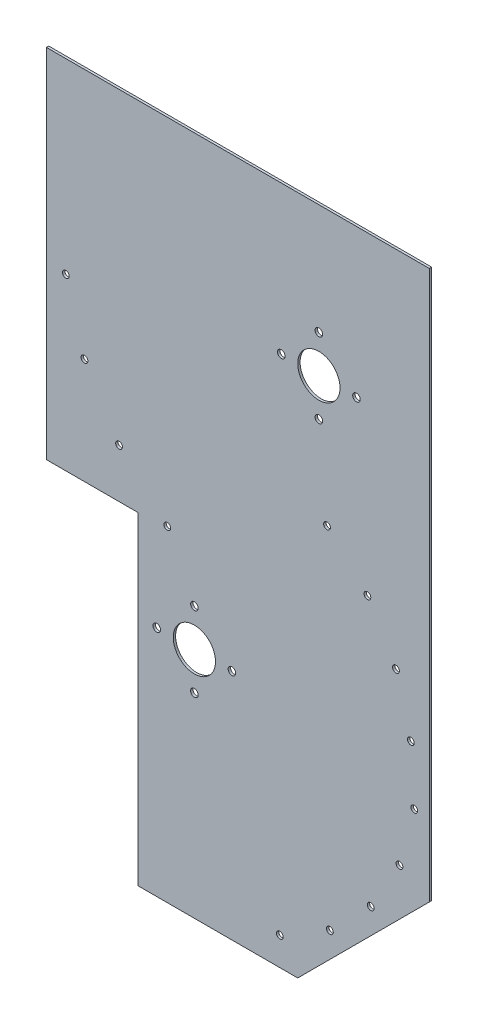
ISO-10303-21;
HEADER;
FILE_DESCRIPTION(('STEP AP214'),'2;1');
FILE_NAME('part.step','',(''),(''),'','','');
FILE_SCHEMA(('AUTOMOTIVE_DESIGN { 1 0 10303 214 1 1 1 1 }'));
ENDSEC;
DATA;
#1=APPLICATION_CONTEXT('core data for automotive mechanical design processes');
#2=APPLICATION_PROTOCOL_DEFINITION('international standard','automotive_design',2000,#1);
#3=PRODUCT_CONTEXT('',#1,'mechanical');
#4=PRODUCT('Part','Part','',(#3));
#5=PRODUCT_RELATED_PRODUCT_CATEGORY('part','',(#4));
#6=PRODUCT_DEFINITION_FORMATION('','',#4);
#7=PRODUCT_DEFINITION_CONTEXT('part definition',#1,'design');
#8=PRODUCT_DEFINITION('design','',#6,#7);
#9=PRODUCT_DEFINITION_SHAPE('','',#8);
#10=(LENGTH_UNIT() NAMED_UNIT(*) SI_UNIT(.MILLI.,.METRE.));
#11=(NAMED_UNIT(*) PLANE_ANGLE_UNIT() SI_UNIT($,.RADIAN.));
#12=(NAMED_UNIT(*) SI_UNIT($,.STERADIAN.) SOLID_ANGLE_UNIT());
#13=UNCERTAINTY_MEASURE_WITH_UNIT(LENGTH_MEASURE(1.E-05),#10,'distance_accuracy_value','');
#14=(GEOMETRIC_REPRESENTATION_CONTEXT(3) GLOBAL_UNCERTAINTY_ASSIGNED_CONTEXT((#13)) GLOBAL_UNIT_ASSIGNED_CONTEXT((#10,
#11,#12)) REPRESENTATION_CONTEXT('',''));
#15=CARTESIAN_POINT('',(0.,0.,0.));
#16=DIRECTION('',(0.,0.,1.));
#17=DIRECTION('',(1.,0.,0.));
#18=AXIS2_PLACEMENT_3D('',#15,#16,#17);
#19=CARTESIAN_POINT('',(-184.15,0.,1.5875));
#20=DIRECTION('',(1.,0.,0.));
#21=DIRECTION('',(0.,0.,-1.));
#22=AXIS2_PLACEMENT_3D('',#19,#20,#21);
#23=PLANE('',#22);
#24=DIRECTION('',(0.,0.,1.));
#25=VECTOR('',#24,1.);
#26=CARTESIAN_POINT('',(-184.15,-141.174215072483,0.));
#27=LINE('',#26,#25);
#28=CARTESIAN_POINT('',(-184.15,-141.174215072483,0.));
#29=VERTEX_POINT('',#28);
#30=CARTESIAN_POINT('',(-184.15,-141.174215072483,1.5875));
#31=VERTEX_POINT('',#30);
#32=EDGE_CURVE('E126',#29,#31,#27,.T.);
#33=ORIENTED_EDGE('',*,*,#32,.T.);
#34=DIRECTION('',(0.,-1.,0.));
#35=VECTOR('',#34,1.);
#36=CARTESIAN_POINT('',(-184.15,0.,1.5875));
#37=LINE('',#36,#35);
#38=CARTESIAN_POINT('',(-184.15,100.125784927517,1.5875));
#39=VERTEX_POINT('',#38);
#40=EDGE_CURVE('E144',#39,#31,#37,.T.);
#41=ORIENTED_EDGE('',*,*,#40,.F.);
#42=DIRECTION('',(0.,0.,-1.));
#43=VECTOR('',#42,1.);
#44=CARTESIAN_POINT('',(-184.15,100.125784927517,1.5875));
#45=LINE('',#44,#43);
#46=CARTESIAN_POINT('',(-184.15,100.125784927517,0.));
#47=VERTEX_POINT('',#46);
#48=EDGE_CURVE('E298',#39,#47,#45,.T.);
#49=ORIENTED_EDGE('',*,*,#48,.T.);
#50=DIRECTION('',(0.,-1.,0.));
#51=VECTOR('',#50,1.);
#52=CARTESIAN_POINT('',(-184.15,0.,0.));
#53=LINE('',#52,#51);
#54=EDGE_CURVE('E110',#47,#29,#53,.T.);
#55=ORIENTED_EDGE('',*,*,#54,.T.);
#56=EDGE_LOOP('',(#33,#41,#49,#55));
#57=FACE_BOUND('',#56,.T.);
#58=ADVANCED_FACE('F36',(#57),#23,.F.);
#59=CARTESIAN_POINT('',(0.,-359.614215072483,1.5875));
#60=DIRECTION('',(0.,-1.,0.));
#61=DIRECTION('',(1.,0.,0.));
#62=AXIS2_PLACEMENT_3D('',#59,#60,#61);
#63=PLANE('',#62);
#64=DIRECTION('',(-1.,0.,0.));
#65=VECTOR('',#64,1.);
#66=CARTESIAN_POINT('',(0.,-359.614215072483,0.));
#67=LINE('',#66,#65);
#68=CARTESIAN_POINT('',(-14.2875000000004,-359.614215072483,0.));
#69=VERTEX_POINT('',#68);
#70=CARTESIAN_POINT('',(-122.2375,-359.614215072483,0.));
#71=VERTEX_POINT('',#70);
#72=EDGE_CURVE('E103',#69,#71,#67,.T.);
#73=ORIENTED_EDGE('',*,*,#72,.F.);
#74=DIRECTION('',(0.,0.,1.));
#75=VECTOR('',#74,1.);
#76=CARTESIAN_POINT('',(-14.2875000000004,-359.614215072483,1.5875));
#77=LINE('',#76,#75);
#78=CARTESIAN_POINT('',(-14.2875000000004,-359.614215072483,1.5875));
#79=VERTEX_POINT('',#78);
#80=EDGE_CURVE('E44',#69,#79,#77,.T.);
#81=ORIENTED_EDGE('',*,*,#80,.T.);
#82=DIRECTION('',(-1.,0.,0.));
#83=VECTOR('',#82,1.);
#84=CARTESIAN_POINT('',(0.,-359.614215072483,1.5875));
#85=LINE('',#84,#83);
#86=CARTESIAN_POINT('',(-122.2375,-359.614215072483,1.5875));
#87=VERTEX_POINT('',#86);
#88=EDGE_CURVE('E124',#79,#87,#85,.T.);
#89=ORIENTED_EDGE('',*,*,#88,.T.);
#90=DIRECTION('',(0.,0.,1.));
#91=VECTOR('',#90,1.);
#92=CARTESIAN_POINT('',(-122.2375,-359.614215072483,0.));
#93=LINE('',#92,#91);
#94=EDGE_CURVE('E116',#71,#87,#93,.T.);
#95=ORIENTED_EDGE('',*,*,#94,.F.);
#96=EDGE_LOOP('',(#73,#81,#89,#95));
#97=FACE_BOUND('',#96,.T.);
#98=ADVANCED_FACE('F123',(#97),#63,.T.);
#99=CARTESIAN_POINT('',(0.,0.,1.5875));
#100=DIRECTION('',(0.,0.,1.));
#101=DIRECTION('',(1.,0.,0.));
#102=AXIS2_PLACEMENT_3D('',#99,#100,#101);
#103=PLANE('',#102);
#104=DIRECTION('',(0.,-1.,0.));
#105=VECTOR('',#104,1.);
#106=CARTESIAN_POINT('',(73.025,0.,1.5875));
#107=LINE('',#106,#105);
#108=CARTESIAN_POINT('',(73.025,-197.80584280919,1.5875));
#109=VERTEX_POINT('',#108);
#110=CARTESIAN_POINT('',(73.0250000000001,-206.741987335774,1.5875));
#111=VERTEX_POINT('',#110);
#112=EDGE_CURVE('E131',#109,#111,#107,.T.);
#113=ORIENTED_EDGE('',*,*,#112,.F.);
#114=CARTESIAN_POINT('',(-84.1374999999999,-202.273915072483,1.5875));
#115=DIRECTION('',(0.,0.,1.));
#116=DIRECTION('',(1.,0.,0.));
#117=AXIS2_PLACEMENT_3D('',#114,#115,#116);
#118=CIRCLE('',#117,157.226);
#119=EDGE_CURVE('E134',#111,#109,#118,.T.);
#120=ORIENTED_EDGE('',*,*,#119,.F.);
#121=EDGE_LOOP('',(#113,#120));
#122=FACE_BOUND('',#121,.T.);
#123=CARTESIAN_POINT('',(-109.5375,-202.273915072483,1.5875));
#124=DIRECTION('',(0.,0.,1.));
#125=DIRECTION('',(1.,0.,0.));
#126=AXIS2_PLACEMENT_3D('',#123,#124,#125);
#127=CIRCLE('',#126,2.55270000000001);
#128=CARTESIAN_POINT('',(-106.9848,-202.273915072483,1.5875));
#129=VERTEX_POINT('',#128);
#130=EDGE_CURVE('E148',#129,#129,#127,.T.);
#131=ORIENTED_EDGE('',*,*,#130,.F.);
#132=EDGE_LOOP('',(#131));
#133=FACE_BOUND('',#132,.T.);
#134=CARTESIAN_POINT('',(-84.1374999999999,-227.673915072483,1.5875));
#135=DIRECTION('',(0.,0.,1.));
#136=DIRECTION('',(1.,0.,0.));
#137=AXIS2_PLACEMENT_3D('',#134,#135,#136);
#138=CIRCLE('',#137,2.55270000000001);
#139=CARTESIAN_POINT('',(-81.5847999999999,-227.673915072483,1.5875));
#140=VERTEX_POINT('',#139);
#141=EDGE_CURVE('E151',#140,#140,#138,.T.);
#142=ORIENTED_EDGE('',*,*,#141,.F.);
#143=EDGE_LOOP('',(#142));
#144=FACE_BOUND('',#143,.T.);
#145=CARTESIAN_POINT('',(-58.7374999999999,-202.273915072483,1.5875));
#146=DIRECTION('',(0.,0.,1.));
#147=DIRECTION('',(1.,0.,0.));
#148=AXIS2_PLACEMENT_3D('',#145,#146,#147);
#149=CIRCLE('',#148,2.5527);
#150=CARTESIAN_POINT('',(-56.1847999999999,-202.273915072483,1.5875));
#151=VERTEX_POINT('',#150);
#152=EDGE_CURVE('E154',#151,#151,#149,.T.);
#153=ORIENTED_EDGE('',*,*,#152,.F.);
#154=EDGE_LOOP('',(#153));
#155=FACE_BOUND('',#154,.T.);
#156=CARTESIAN_POINT('',(-84.1374999999999,-176.873915072483,1.5875));
#157=DIRECTION('',(0.,0.,1.));
#158=DIRECTION('',(1.,0.,0.));
#159=AXIS2_PLACEMENT_3D('',#156,#157,#158);
#160=CIRCLE('',#159,2.55270000000001);
#161=CARTESIAN_POINT('',(-81.5847999999999,-176.873915072483,1.5875));
#162=VERTEX_POINT('',#161);
#163=EDGE_CURVE('E157',#162,#162,#160,.T.);
#164=ORIENTED_EDGE('',*,*,#163,.F.);
#165=EDGE_LOOP('',(#164));
#166=FACE_BOUND('',#165,.T.);
#167=CARTESIAN_POINT('',(0.,-25.4,1.5875));
#168=DIRECTION('',(0.,0.,1.));
#169=DIRECTION('',(1.,0.,0.));
#170=AXIS2_PLACEMENT_3D('',#167,#168,#169);
#171=CIRCLE('',#170,2.5527);
#172=CARTESIAN_POINT('',(2.5527,-25.4,1.5875));
#173=VERTEX_POINT('',#172);
#174=EDGE_CURVE('E160',#173,#173,#171,.T.);
#175=ORIENTED_EDGE('',*,*,#174,.F.);
#176=EDGE_LOOP('',(#175));
#177=FACE_BOUND('',#176,.T.);
#178=CARTESIAN_POINT('',(25.4,0.,1.5875));
#179=DIRECTION('',(0.,0.,1.));
#180=DIRECTION('',(1.,0.,0.));
#181=AXIS2_PLACEMENT_3D('',#178,#179,#180);
#182=CIRCLE('',#181,2.5527);
#183=CARTESIAN_POINT('',(27.9527,0.,1.5875));
#184=VERTEX_POINT('',#183);
#185=EDGE_CURVE('E163',#184,#184,#182,.T.);
#186=ORIENTED_EDGE('',*,*,#185,.F.);
#187=EDGE_LOOP('',(#186));
#188=FACE_BOUND('',#187,.T.);
#189=CARTESIAN_POINT('',(0.,25.4,1.5875));
#190=DIRECTION('',(0.,0.,1.));
#191=DIRECTION('',(1.,0.,0.));
#192=AXIS2_PLACEMENT_3D('',#189,#190,#191);
#193=CIRCLE('',#192,2.5527);
#194=CARTESIAN_POINT('',(2.5527,25.4,1.5875));
#195=VERTEX_POINT('',#194);
#196=EDGE_CURVE('E166',#195,#195,#193,.T.);
#197=ORIENTED_EDGE('',*,*,#196,.F.);
#198=EDGE_LOOP('',(#197));
#199=FACE_BOUND('',#198,.T.);
#200=CARTESIAN_POINT('',(-25.4,0.,1.5875));
#201=DIRECTION('',(0.,0.,1.));
#202=DIRECTION('',(1.,0.,0.));
#203=AXIS2_PLACEMENT_3D('',#200,#201,#202);
#204=CIRCLE('',#203,2.5527);
#205=CARTESIAN_POINT('',(-22.8473,0.,1.5875));
#206=VERTEX_POINT('',#205);
#207=EDGE_CURVE('E169',#206,#206,#204,.T.);
#208=ORIENTED_EDGE('',*,*,#207,.F.);
#209=EDGE_LOOP('',(#208));
#210=FACE_BOUND('',#209,.T.);
#211=CARTESIAN_POINT('',(-26.3697145025192,-340.552266808093,1.5875));
#212=DIRECTION('',(0.,0.,1.));
#213=DIRECTION('',(1.,0.,0.));
#214=AXIS2_PLACEMENT_3D('',#211,#212,#213);
#215=CIRCLE('',#214,2.28600000000344);
#216=CARTESIAN_POINT('',(-24.0837145025158,-340.552266808093,1.5875));
#217=VERTEX_POINT('',#216);
#218=EDGE_CURVE('E172',#217,#217,#215,.T.);
#219=ORIENTED_EDGE('',*,*,#218,.F.);
#220=EDGE_LOOP('',(#219));
#221=FACE_BOUND('',#220,.T.);
#222=CARTESIAN_POINT('',(7.45096689410994,-320.889143150443,1.5875));
#223=DIRECTION('',(0.,0.,1.));
#224=DIRECTION('',(1.,0.,0.));
#225=AXIS2_PLACEMENT_3D('',#222,#223,#224);
#226=CIRCLE('',#225,2.28599999999998);
#227=CARTESIAN_POINT('',(9.73696689410992,-320.889143150443,1.5875));
#228=VERTEX_POINT('',#227);
#229=EDGE_CURVE('E175',#228,#228,#226,.T.);
#230=ORIENTED_EDGE('',*,*,#229,.F.);
#231=EDGE_LOOP('',(#230));
#232=FACE_BOUND('',#231,.T.);
#233=CARTESIAN_POINT('',(35.0300456289976,-293.142587720215,1.5875));
#234=DIRECTION('',(0.,0.,1.));
#235=DIRECTION('',(1.,0.,0.));
#236=AXIS2_PLACEMENT_3D('',#233,#234,#235);
#237=CIRCLE('',#236,2.28599999999999);
#238=CARTESIAN_POINT('',(37.3160456289976,-293.142587720215,1.5875));
#239=VERTEX_POINT('',#238);
#240=EDGE_CURVE('E178',#239,#239,#237,.T.);
#241=ORIENTED_EDGE('',*,*,#240,.F.);
#242=EDGE_LOOP('',(#241));
#243=FACE_BOUND('',#242,.T.);
#244=CARTESIAN_POINT('',(54.4880530629494,-259.203482416627,1.5875));
#245=DIRECTION('',(0.,0.,1.));
#246=DIRECTION('',(1.,0.,0.));
#247=AXIS2_PLACEMENT_3D('',#244,#245,#246);
#248=CIRCLE('',#247,2.28599999999999);
#249=CARTESIAN_POINT('',(56.7740530629494,-259.203482416627,1.5875));
#250=VERTEX_POINT('',#249);
#251=EDGE_CURVE('E181',#250,#250,#248,.T.);
#252=ORIENTED_EDGE('',*,*,#251,.F.);
#253=EDGE_LOOP('',(#252));
#254=FACE_BOUND('',#253,.T.);
#255=CARTESIAN_POINT('',(62.145886507959,-182.799411028398,1.5875));
#256=DIRECTION('',(0.,0.,1.));
#257=DIRECTION('',(1.,0.,0.));
#258=AXIS2_PLACEMENT_3D('',#255,#256,#257);
#259=CIRCLE('',#258,2.28600000000002);
#260=CARTESIAN_POINT('',(64.431886507959,-182.799411028398,1.5875));
#261=VERTEX_POINT('',#260);
#262=EDGE_CURVE('E184',#261,#261,#259,.T.);
#263=ORIENTED_EDGE('',*,*,#262,.F.);
#264=EDGE_LOOP('',(#263));
#265=FACE_BOUND('',#264,.T.);
#266=CARTESIAN_POINT('',(52.121028444528,-145.602062251777,1.5875));
#267=DIRECTION('',(0.,0.,1.));
#268=DIRECTION('',(1.,0.,0.));
#269=AXIS2_PLACEMENT_3D('',#266,#267,#268);
#270=CIRCLE('',#269,2.28600000000001);
#271=CARTESIAN_POINT('',(54.4070284445281,-145.602062251777,1.5875));
#272=VERTEX_POINT('',#271);
#273=EDGE_CURVE('E187',#272,#272,#270,.T.);
#274=ORIENTED_EDGE('',*,*,#273,.F.);
#275=EDGE_LOOP('',(#274));
#276=FACE_BOUND('',#275,.T.);
#277=CARTESIAN_POINT('',(32.8103768454675,-112.266806590223,1.5875));
#278=DIRECTION('',(0.,0.,1.));
#279=DIRECTION('',(1.,0.,0.));
#280=AXIS2_PLACEMENT_3D('',#277,#278,#279);
#281=CIRCLE('',#280,2.28600000000001);
#282=CARTESIAN_POINT('',(35.0963768454675,-112.266806590223,1.5875));
#283=VERTEX_POINT('',#282);
#284=EDGE_CURVE('E190',#283,#283,#281,.T.);
#285=ORIENTED_EDGE('',*,*,#284,.F.);
#286=EDGE_LOOP('',(#285));
#287=FACE_BOUND('',#286,.T.);
#288=CARTESIAN_POINT('',(5.5299207048925,-85.0653866279545,1.5875));
#289=DIRECTION('',(0.,0.,1.));
#290=DIRECTION('',(1.,0.,0.));
#291=AXIS2_PLACEMENT_3D('',#288,#289,#290);
#292=CIRCLE('',#291,2.28600000000133);
#293=CARTESIAN_POINT('',(7.81592070489383,-85.0653866279545,1.5875));
#294=VERTEX_POINT('',#293);
#295=EDGE_CURVE('E193',#294,#294,#292,.T.);
#296=ORIENTED_EDGE('',*,*,#295,.F.);
#297=EDGE_LOOP('',(#296));
#298=FACE_BOUND('',#297,.T.);
#299=CARTESIAN_POINT('',(-170.99420071255,-26.0957467545194,1.5875));
#300=DIRECTION('',(0.,0.,1.));
#301=DIRECTION('',(1.,0.,0.));
#302=AXIS2_PLACEMENT_3D('',#299,#300,#301);
#303=CIRCLE('',#302,2.28600000000001);
#304=CARTESIAN_POINT('',(-168.70820071255,-26.0957467545194,1.5875));
#305=VERTEX_POINT('',#304);
#306=EDGE_CURVE('E196',#305,#305,#303,.T.);
#307=ORIENTED_EDGE('',*,*,#306,.F.);
#308=EDGE_LOOP('',(#307));
#309=FACE_BOUND('',#308,.T.);
#310=CARTESIAN_POINT('',(-158.413638357667,-69.4631114929805,1.5875));
#311=DIRECTION('',(0.,0.,1.));
#312=DIRECTION('',(1.,0.,0.));
#313=AXIS2_PLACEMENT_3D('',#310,#311,#312);
#314=CIRCLE('',#313,2.28600000000001);
#315=CARTESIAN_POINT('',(-156.127638357667,-69.4631114929805,1.5875));
#316=VERTEX_POINT('',#315);
#317=EDGE_CURVE('E199',#316,#316,#314,.T.);
#318=ORIENTED_EDGE('',*,*,#317,.F.);
#319=EDGE_LOOP('',(#318));
#320=FACE_BOUND('',#319,.T.);
#321=CARTESIAN_POINT('',(-135.037448339624,-108.096679976414,1.5875));
#322=DIRECTION('',(0.,0.,1.));
#323=DIRECTION('',(1.,0.,0.));
#324=AXIS2_PLACEMENT_3D('',#321,#322,#323);
#325=CIRCLE('',#324,2.28600000000001);
#326=CARTESIAN_POINT('',(-132.751448339624,-108.096679976414,1.5875));
#327=VERTEX_POINT('',#326);
#328=EDGE_CURVE('E202',#327,#327,#325,.T.);
#329=ORIENTED_EDGE('',*,*,#328,.F.);
#330=EDGE_LOOP('',(#329));
#331=FACE_BOUND('',#330,.T.);
#332=CARTESIAN_POINT('',(-102.45867937717,-139.363638357666,1.5875));
#333=DIRECTION('',(0.,0.,1.));
#334=DIRECTION('',(1.,0.,0.));
#335=AXIS2_PLACEMENT_3D('',#332,#333,#334);
#336=CIRCLE('',#335,2.28600000000001);
#337=CARTESIAN_POINT('',(-100.17267937717,-139.363638357666,1.5875));
#338=VERTEX_POINT('',#337);
#339=EDGE_CURVE('E205',#338,#338,#336,.T.);
#340=ORIENTED_EDGE('',*,*,#339,.F.);
#341=EDGE_LOOP('',(#340));
#342=FACE_BOUND('',#341,.T.);
#343=CARTESIAN_POINT('',(64.4989581452197,-221.38472117909,1.5875));
#344=DIRECTION('',(0.,0.,1.));
#345=DIRECTION('',(1.,0.,0.));
#346=AXIS2_PLACEMENT_3D('',#343,#344,#345);
#347=CIRCLE('',#346,2.28599999999999);
#348=CARTESIAN_POINT('',(66.7849581452197,-221.38472117909,1.5875));
#349=VERTEX_POINT('',#348);
#350=EDGE_CURVE('E208',#349,#349,#347,.T.);
#351=ORIENTED_EDGE('',*,*,#350,.F.);
#352=EDGE_LOOP('',(#351));
#353=FACE_BOUND('',#352,.T.);
#354=CARTESIAN_POINT('',(-84.1374999999999,-202.273915072483,1.5875));
#355=DIRECTION('',(0.,0.,1.));
#356=DIRECTION('',(1.,0.,0.));
#357=AXIS2_PLACEMENT_3D('',#354,#355,#356);
#358=CIRCLE('',#357,14.2874999999999);
#359=CARTESIAN_POINT('',(-69.85,-202.273915072483,1.5875));
#360=VERTEX_POINT('',#359);
#361=EDGE_CURVE('E211',#360,#360,#358,.T.);
#362=ORIENTED_EDGE('',*,*,#361,.F.);
#363=EDGE_LOOP('',(#362));
#364=FACE_BOUND('',#363,.T.);
#365=CARTESIAN_POINT('',(0.,0.,1.5875));
#366=DIRECTION('',(0.,0.,1.));
#367=DIRECTION('',(1.,0.,0.));
#368=AXIS2_PLACEMENT_3D('',#365,#366,#367);
#369=CIRCLE('',#368,14.2875);
#370=CARTESIAN_POINT('',(14.2875,0.,1.5875));
#371=VERTEX_POINT('',#370);
#372=EDGE_CURVE('E214',#371,#371,#369,.T.);
#373=ORIENTED_EDGE('',*,*,#372,.F.);
#374=EDGE_LOOP('',(#373));
#375=FACE_BOUND('',#374,.T.);
#376=ORIENTED_EDGE('',*,*,#88,.F.);
#377=DIRECTION('',(-0.707106781186549,-0.707106781186546,0.));
#378=VECTOR('',#377,1.);
#379=CARTESIAN_POINT('',(172.663357536241,-172.663357536242,1.5875));
#380=LINE('',#379,#378);
#381=CARTESIAN_POINT('',(74.6125000000001,-270.714215072483,1.5875));
#382=VERTEX_POINT('',#381);
#383=EDGE_CURVE('E11',#79,#382,#380,.F.);
#384=ORIENTED_EDGE('',*,*,#383,.T.);
#385=DIRECTION('',(0.,-1.,0.));
#386=VECTOR('',#385,1.);
#387=CARTESIAN_POINT('',(74.6125000000001,0.,1.5875));
#388=LINE('',#387,#386);
#389=CARTESIAN_POINT('',(74.6125000000001,100.125784927517,1.5875));
#390=VERTEX_POINT('',#389);
#391=EDGE_CURVE('E138',#390,#382,#388,.T.);
#392=ORIENTED_EDGE('',*,*,#391,.F.);
#393=DIRECTION('',(1.,0.,0.));
#394=VECTOR('',#393,1.);
#395=CARTESIAN_POINT('',(0.,100.125784927517,1.5875));
#396=LINE('',#395,#394);
#397=EDGE_CURVE('E141',#39,#390,#396,.T.);
#398=ORIENTED_EDGE('',*,*,#397,.F.);
#399=ORIENTED_EDGE('',*,*,#40,.T.);
#400=DIRECTION('',(1.,0.,0.));
#401=VECTOR('',#400,1.);
#402=CARTESIAN_POINT('',(-184.15,-141.174215072483,1.5875));
#403=LINE('',#402,#401);
#404=CARTESIAN_POINT('',(-122.2375,-141.174215072483,1.5875));
#405=VERTEX_POINT('',#404);
#406=EDGE_CURVE('E121',#31,#405,#403,.T.);
#407=ORIENTED_EDGE('',*,*,#406,.T.);
#408=DIRECTION('',(0.,-1.,0.));
#409=VECTOR('',#408,1.);
#410=CARTESIAN_POINT('',(-122.2375,-141.174215072483,1.5875));
#411=LINE('',#410,#409);
#412=EDGE_CURVE('E554',#405,#87,#411,.T.);
#413=ORIENTED_EDGE('',*,*,#412,.T.);
#414=EDGE_LOOP('',(#376,#384,#392,#398,#399,#407,#413));
#415=FACE_BOUND('',#414,.T.);
#416=ADVANCED_FACE('F322',(#122,#133,#144,#155,#166,#177,#188,#199,#210,#221,#232,#243,#254,
#265,#276,#287,#298,#309,#320,#331,#342,#353,#364,#375,#415),#103,.T.);
#417=CARTESIAN_POINT('',(0.,0.,0.));
#418=DIRECTION('',(0.,0.,1.));
#419=DIRECTION('',(1.,0.,0.));
#420=AXIS2_PLACEMENT_3D('',#417,#418,#419);
#421=PLANE('',#420);
#422=CARTESIAN_POINT('',(0.,0.,0.));
#423=DIRECTION('',(0.,0.,1.));
#424=DIRECTION('',(1.,0.,0.));
#425=AXIS2_PLACEMENT_3D('',#422,#423,#424);
#426=CIRCLE('',#425,14.2875);
#427=CARTESIAN_POINT('',(14.2875,0.,0.));
#428=VERTEX_POINT('',#427);
#429=EDGE_CURVE('E135',#428,#428,#426,.T.);
#430=ORIENTED_EDGE('',*,*,#429,.T.);
#431=EDGE_LOOP('',(#430));
#432=FACE_BOUND('',#431,.T.);
#433=CARTESIAN_POINT('',(-84.1374999999999,-202.273915072483,0.));
#434=DIRECTION('',(0.,0.,1.));
#435=DIRECTION('',(1.,0.,0.));
#436=AXIS2_PLACEMENT_3D('',#433,#434,#435);
#437=CIRCLE('',#436,14.2874999999999);
#438=CARTESIAN_POINT('',(-69.85,-202.273915072483,0.));
#439=VERTEX_POINT('',#438);
#440=EDGE_CURVE('E293',#439,#439,#437,.T.);
#441=ORIENTED_EDGE('',*,*,#440,.T.);
#442=EDGE_LOOP('',(#441));
#443=FACE_BOUND('',#442,.T.);
#444=CARTESIAN_POINT('',(64.4989581452197,-221.38472117909,0.));
#445=DIRECTION('',(0.,0.,1.));
#446=DIRECTION('',(1.,0.,0.));
#447=AXIS2_PLACEMENT_3D('',#444,#445,#446);
#448=CIRCLE('',#447,2.28599999999999);
#449=CARTESIAN_POINT('',(66.7849581452197,-221.38472117909,0.));
#450=VERTEX_POINT('',#449);
#451=EDGE_CURVE('E290',#450,#450,#448,.T.);
#452=ORIENTED_EDGE('',*,*,#451,.T.);
#453=EDGE_LOOP('',(#452));
#454=FACE_BOUND('',#453,.T.);
#455=CARTESIAN_POINT('',(-102.45867937717,-139.363638357666,0.));
#456=DIRECTION('',(0.,0.,1.));
#457=DIRECTION('',(1.,0.,0.));
#458=AXIS2_PLACEMENT_3D('',#455,#456,#457);
#459=CIRCLE('',#458,2.28600000000001);
#460=CARTESIAN_POINT('',(-100.17267937717,-139.363638357666,0.));
#461=VERTEX_POINT('',#460);
#462=EDGE_CURVE('E287',#461,#461,#459,.T.);
#463=ORIENTED_EDGE('',*,*,#462,.T.);
#464=EDGE_LOOP('',(#463));
#465=FACE_BOUND('',#464,.T.);
#466=CARTESIAN_POINT('',(-135.037448339624,-108.096679976414,0.));
#467=DIRECTION('',(0.,0.,1.));
#468=DIRECTION('',(1.,0.,0.));
#469=AXIS2_PLACEMENT_3D('',#466,#467,#468);
#470=CIRCLE('',#469,2.28600000000001);
#471=CARTESIAN_POINT('',(-132.751448339624,-108.096679976414,0.));
#472=VERTEX_POINT('',#471);
#473=EDGE_CURVE('E284',#472,#472,#470,.T.);
#474=ORIENTED_EDGE('',*,*,#473,.T.);
#475=EDGE_LOOP('',(#474));
#476=FACE_BOUND('',#475,.T.);
#477=CARTESIAN_POINT('',(-158.413638357667,-69.4631114929805,0.));
#478=DIRECTION('',(0.,0.,1.));
#479=DIRECTION('',(1.,0.,0.));
#480=AXIS2_PLACEMENT_3D('',#477,#478,#479);
#481=CIRCLE('',#480,2.28600000000001);
#482=CARTESIAN_POINT('',(-156.127638357667,-69.4631114929805,0.));
#483=VERTEX_POINT('',#482);
#484=EDGE_CURVE('E281',#483,#483,#481,.T.);
#485=ORIENTED_EDGE('',*,*,#484,.T.);
#486=EDGE_LOOP('',(#485));
#487=FACE_BOUND('',#486,.T.);
#488=CARTESIAN_POINT('',(-170.99420071255,-26.0957467545194,0.));
#489=DIRECTION('',(0.,0.,1.));
#490=DIRECTION('',(1.,0.,0.));
#491=AXIS2_PLACEMENT_3D('',#488,#489,#490);
#492=CIRCLE('',#491,2.28600000000001);
#493=CARTESIAN_POINT('',(-168.70820071255,-26.0957467545194,0.));
#494=VERTEX_POINT('',#493);
#495=EDGE_CURVE('E278',#494,#494,#492,.T.);
#496=ORIENTED_EDGE('',*,*,#495,.T.);
#497=EDGE_LOOP('',(#496));
#498=FACE_BOUND('',#497,.T.);
#499=CARTESIAN_POINT('',(5.5299207048925,-85.0653866279545,0.));
#500=DIRECTION('',(0.,0.,1.));
#501=DIRECTION('',(1.,0.,0.));
#502=AXIS2_PLACEMENT_3D('',#499,#500,#501);
#503=CIRCLE('',#502,2.28600000000133);
#504=CARTESIAN_POINT('',(7.81592070489383,-85.0653866279545,0.));
#505=VERTEX_POINT('',#504);
#506=EDGE_CURVE('E275',#505,#505,#503,.T.);
#507=ORIENTED_EDGE('',*,*,#506,.T.);
#508=EDGE_LOOP('',(#507));
#509=FACE_BOUND('',#508,.T.);
#510=CARTESIAN_POINT('',(32.8103768454675,-112.266806590223,0.));
#511=DIRECTION('',(0.,0.,1.));
#512=DIRECTION('',(1.,0.,0.));
#513=AXIS2_PLACEMENT_3D('',#510,#511,#512);
#514=CIRCLE('',#513,2.28600000000001);
#515=CARTESIAN_POINT('',(35.0963768454675,-112.266806590223,0.));
#516=VERTEX_POINT('',#515);
#517=EDGE_CURVE('E272',#516,#516,#514,.T.);
#518=ORIENTED_EDGE('',*,*,#517,.T.);
#519=EDGE_LOOP('',(#518));
#520=FACE_BOUND('',#519,.T.);
#521=CARTESIAN_POINT('',(52.121028444528,-145.602062251777,0.));
#522=DIRECTION('',(0.,0.,1.));
#523=DIRECTION('',(1.,0.,0.));
#524=AXIS2_PLACEMENT_3D('',#521,#522,#523);
#525=CIRCLE('',#524,2.28600000000001);
#526=CARTESIAN_POINT('',(54.4070284445281,-145.602062251777,0.));
#527=VERTEX_POINT('',#526);
#528=EDGE_CURVE('E269',#527,#527,#525,.T.);
#529=ORIENTED_EDGE('',*,*,#528,.T.);
#530=EDGE_LOOP('',(#529));
#531=FACE_BOUND('',#530,.T.);
#532=CARTESIAN_POINT('',(62.145886507959,-182.799411028398,0.));
#533=DIRECTION('',(0.,0.,1.));
#534=DIRECTION('',(1.,0.,0.));
#535=AXIS2_PLACEMENT_3D('',#532,#533,#534);
#536=CIRCLE('',#535,2.28600000000002);
#537=CARTESIAN_POINT('',(64.431886507959,-182.799411028398,0.));
#538=VERTEX_POINT('',#537);
#539=EDGE_CURVE('E266',#538,#538,#536,.T.);
#540=ORIENTED_EDGE('',*,*,#539,.T.);
#541=EDGE_LOOP('',(#540));
#542=FACE_BOUND('',#541,.T.);
#543=CARTESIAN_POINT('',(54.4880530629494,-259.203482416627,0.));
#544=DIRECTION('',(0.,0.,1.));
#545=DIRECTION('',(1.,0.,0.));
#546=AXIS2_PLACEMENT_3D('',#543,#544,#545);
#547=CIRCLE('',#546,2.28599999999999);
#548=CARTESIAN_POINT('',(56.7740530629494,-259.203482416627,0.));
#549=VERTEX_POINT('',#548);
#550=EDGE_CURVE('E263',#549,#549,#547,.T.);
#551=ORIENTED_EDGE('',*,*,#550,.T.);
#552=EDGE_LOOP('',(#551));
#553=FACE_BOUND('',#552,.T.);
#554=CARTESIAN_POINT('',(35.0300456289976,-293.142587720215,0.));
#555=DIRECTION('',(0.,0.,1.));
#556=DIRECTION('',(1.,0.,0.));
#557=AXIS2_PLACEMENT_3D('',#554,#555,#556);
#558=CIRCLE('',#557,2.28599999999999);
#559=CARTESIAN_POINT('',(37.3160456289976,-293.142587720215,0.));
#560=VERTEX_POINT('',#559);
#561=EDGE_CURVE('E260',#560,#560,#558,.T.);
#562=ORIENTED_EDGE('',*,*,#561,.T.);
#563=EDGE_LOOP('',(#562));
#564=FACE_BOUND('',#563,.T.);
#565=CARTESIAN_POINT('',(7.45096689410994,-320.889143150443,0.));
#566=DIRECTION('',(0.,0.,1.));
#567=DIRECTION('',(1.,0.,0.));
#568=AXIS2_PLACEMENT_3D('',#565,#566,#567);
#569=CIRCLE('',#568,2.28599999999998);
#570=CARTESIAN_POINT('',(9.73696689410992,-320.889143150443,0.));
#571=VERTEX_POINT('',#570);
#572=EDGE_CURVE('E257',#571,#571,#569,.T.);
#573=ORIENTED_EDGE('',*,*,#572,.T.);
#574=EDGE_LOOP('',(#573));
#575=FACE_BOUND('',#574,.T.);
#576=CARTESIAN_POINT('',(-26.3697145025192,-340.552266808093,0.));
#577=DIRECTION('',(0.,0.,1.));
#578=DIRECTION('',(1.,0.,0.));
#579=AXIS2_PLACEMENT_3D('',#576,#577,#578);
#580=CIRCLE('',#579,2.28600000000344);
#581=CARTESIAN_POINT('',(-24.0837145025158,-340.552266808093,0.));
#582=VERTEX_POINT('',#581);
#583=EDGE_CURVE('E254',#582,#582,#580,.T.);
#584=ORIENTED_EDGE('',*,*,#583,.T.);
#585=EDGE_LOOP('',(#584));
#586=FACE_BOUND('',#585,.T.);
#587=CARTESIAN_POINT('',(-25.4,0.,0.));
#588=DIRECTION('',(0.,0.,1.));
#589=DIRECTION('',(1.,0.,0.));
#590=AXIS2_PLACEMENT_3D('',#587,#588,#589);
#591=CIRCLE('',#590,2.5527);
#592=CARTESIAN_POINT('',(-22.8473,0.,0.));
#593=VERTEX_POINT('',#592);
#594=EDGE_CURVE('E251',#593,#593,#591,.T.);
#595=ORIENTED_EDGE('',*,*,#594,.T.);
#596=EDGE_LOOP('',(#595));
#597=FACE_BOUND('',#596,.T.);
#598=CARTESIAN_POINT('',(0.,25.4,0.));
#599=DIRECTION('',(0.,0.,1.));
#600=DIRECTION('',(1.,0.,0.));
#601=AXIS2_PLACEMENT_3D('',#598,#599,#600);
#602=CIRCLE('',#601,2.5527);
#603=CARTESIAN_POINT('',(2.5527,25.4,0.));
#604=VERTEX_POINT('',#603);
#605=EDGE_CURVE('E248',#604,#604,#602,.T.);
#606=ORIENTED_EDGE('',*,*,#605,.T.);
#607=EDGE_LOOP('',(#606));
#608=FACE_BOUND('',#607,.T.);
#609=CARTESIAN_POINT('',(25.4,0.,0.));
#610=DIRECTION('',(0.,0.,1.));
#611=DIRECTION('',(1.,0.,0.));
#612=AXIS2_PLACEMENT_3D('',#609,#610,#611);
#613=CIRCLE('',#612,2.5527);
#614=CARTESIAN_POINT('',(27.9527,0.,0.));
#615=VERTEX_POINT('',#614);
#616=EDGE_CURVE('E245',#615,#615,#613,.T.);
#617=ORIENTED_EDGE('',*,*,#616,.T.);
#618=EDGE_LOOP('',(#617));
#619=FACE_BOUND('',#618,.T.);
#620=CARTESIAN_POINT('',(0.,-25.4,0.));
#621=DIRECTION('',(0.,0.,1.));
#622=DIRECTION('',(1.,0.,0.));
#623=AXIS2_PLACEMENT_3D('',#620,#621,#622);
#624=CIRCLE('',#623,2.5527);
#625=CARTESIAN_POINT('',(2.5527,-25.4,0.));
#626=VERTEX_POINT('',#625);
#627=EDGE_CURVE('E242',#626,#626,#624,.T.);
#628=ORIENTED_EDGE('',*,*,#627,.T.);
#629=EDGE_LOOP('',(#628));
#630=FACE_BOUND('',#629,.T.);
#631=CARTESIAN_POINT('',(-84.1374999999999,-176.873915072483,0.));
#632=DIRECTION('',(0.,0.,1.));
#633=DIRECTION('',(1.,0.,0.));
#634=AXIS2_PLACEMENT_3D('',#631,#632,#633);
#635=CIRCLE('',#634,2.55270000000001);
#636=CARTESIAN_POINT('',(-81.5847999999999,-176.873915072483,0.));
#637=VERTEX_POINT('',#636);
#638=EDGE_CURVE('E239',#637,#637,#635,.T.);
#639=ORIENTED_EDGE('',*,*,#638,.T.);
#640=EDGE_LOOP('',(#639));
#641=FACE_BOUND('',#640,.T.);
#642=CARTESIAN_POINT('',(-58.7374999999999,-202.273915072483,0.));
#643=DIRECTION('',(0.,0.,1.));
#644=DIRECTION('',(1.,0.,0.));
#645=AXIS2_PLACEMENT_3D('',#642,#643,#644);
#646=CIRCLE('',#645,2.5527);
#647=CARTESIAN_POINT('',(-56.1847999999999,-202.273915072483,0.));
#648=VERTEX_POINT('',#647);
#649=EDGE_CURVE('E236',#648,#648,#646,.T.);
#650=ORIENTED_EDGE('',*,*,#649,.T.);
#651=EDGE_LOOP('',(#650));
#652=FACE_BOUND('',#651,.T.);
#653=CARTESIAN_POINT('',(-84.1374999999999,-227.673915072483,0.));
#654=DIRECTION('',(0.,0.,1.));
#655=DIRECTION('',(1.,0.,0.));
#656=AXIS2_PLACEMENT_3D('',#653,#654,#655);
#657=CIRCLE('',#656,2.55270000000001);
#658=CARTESIAN_POINT('',(-81.5847999999999,-227.673915072483,0.));
#659=VERTEX_POINT('',#658);
#660=EDGE_CURVE('E233',#659,#659,#657,.T.);
#661=ORIENTED_EDGE('',*,*,#660,.T.);
#662=EDGE_LOOP('',(#661));
#663=FACE_BOUND('',#662,.T.);
#664=CARTESIAN_POINT('',(-109.5375,-202.273915072483,0.));
#665=DIRECTION('',(0.,0.,1.));
#666=DIRECTION('',(1.,0.,0.));
#667=AXIS2_PLACEMENT_3D('',#664,#665,#666);
#668=CIRCLE('',#667,2.55270000000001);
#669=CARTESIAN_POINT('',(-106.9848,-202.273915072483,0.));
#670=VERTEX_POINT('',#669);
#671=EDGE_CURVE('E109',#670,#670,#668,.T.);
#672=ORIENTED_EDGE('',*,*,#671,.T.);
#673=EDGE_LOOP('',(#672));
#674=FACE_BOUND('',#673,.T.);
#675=DIRECTION('',(0.,-1.,0.));
#676=VECTOR('',#675,1.);
#677=CARTESIAN_POINT('',(73.025,0.,0.));
#678=LINE('',#677,#676);
#679=CARTESIAN_POINT('',(73.025,-197.80584280919,0.));
#680=VERTEX_POINT('',#679);
#681=CARTESIAN_POINT('',(73.0250000000001,-206.741987335774,0.));
#682=VERTEX_POINT('',#681);
#683=EDGE_CURVE('E218',#680,#682,#678,.T.);
#684=ORIENTED_EDGE('',*,*,#683,.T.);
#685=CARTESIAN_POINT('',(-84.1374999999999,-202.273915072483,0.));
#686=DIRECTION('',(0.,0.,1.));
#687=DIRECTION('',(1.,0.,0.));
#688=AXIS2_PLACEMENT_3D('',#685,#686,#687);
#689=CIRCLE('',#688,157.226);
#690=EDGE_CURVE('E221',#682,#680,#689,.T.);
#691=ORIENTED_EDGE('',*,*,#690,.T.);
#692=EDGE_LOOP('',(#684,#691));
#693=FACE_BOUND('',#692,.T.);
#694=DIRECTION('',(0.,-1.,0.));
#695=VECTOR('',#694,1.);
#696=CARTESIAN_POINT('',(74.6125000000001,0.,0.));
#697=LINE('',#696,#695);
#698=CARTESIAN_POINT('',(74.6125000000001,100.125784927517,0.));
#699=VERTEX_POINT('',#698);
#700=CARTESIAN_POINT('',(74.6125000000001,-270.714215072483,0.));
#701=VERTEX_POINT('',#700);
#702=EDGE_CURVE('E224',#699,#701,#697,.T.);
#703=ORIENTED_EDGE('',*,*,#702,.T.);
#704=DIRECTION('',(0.707106781186549,0.707106781186546,0.));
#705=VECTOR('',#704,1.);
#706=CARTESIAN_POINT('',(74.6125000000001,-270.714215072483,0.));
#707=LINE('',#706,#705);
#708=EDGE_CURVE('E58',#701,#69,#707,.F.);
#709=ORIENTED_EDGE('',*,*,#708,.T.);
#710=ORIENTED_EDGE('',*,*,#72,.T.);
#711=DIRECTION('',(0.,-1.,0.));
#712=VECTOR('',#711,1.);
#713=CARTESIAN_POINT('',(-122.2375,-141.174215072483,0.));
#714=LINE('',#713,#712);
#715=CARTESIAN_POINT('',(-122.2375,-141.174215072483,0.));
#716=VERTEX_POINT('',#715);
#717=EDGE_CURVE('E107',#716,#71,#714,.T.);
#718=ORIENTED_EDGE('',*,*,#717,.F.);
#719=DIRECTION('',(1.,0.,0.));
#720=VECTOR('',#719,1.);
#721=CARTESIAN_POINT('',(-184.15,-141.174215072483,0.));
#722=LINE('',#721,#720);
#723=EDGE_CURVE('E120',#29,#716,#722,.T.);
#724=ORIENTED_EDGE('',*,*,#723,.F.);
#725=ORIENTED_EDGE('',*,*,#54,.F.);
#726=DIRECTION('',(1.,0.,0.));
#727=VECTOR('',#726,1.);
#728=CARTESIAN_POINT('',(0.,100.125784927517,0.));
#729=LINE('',#728,#727);
#730=EDGE_CURVE('E226',#47,#699,#729,.T.);
#731=ORIENTED_EDGE('',*,*,#730,.T.);
#732=EDGE_LOOP('',(#703,#709,#710,#718,#724,#725,#731));
#733=FACE_BOUND('',#732,.T.);
#734=ADVANCED_FACE('F105',(#432,#443,#454,#465,#476,#487,#498,#509,#520,#531,#542,#553,#564,
#575,#586,#597,#608,#619,#630,#641,#652,#663,#674,#693,#733),#421,.F.);
#735=CARTESIAN_POINT('',(74.6125000000001,0.,1.5875));
#736=DIRECTION('',(1.,0.,0.));
#737=DIRECTION('',(0.,1.,0.));
#738=AXIS2_PLACEMENT_3D('',#735,#736,#737);
#739=PLANE('',#738);
#740=ORIENTED_EDGE('',*,*,#391,.T.);
#741=DIRECTION('',(0.,0.,-1.));
#742=VECTOR('',#741,1.);
#743=CARTESIAN_POINT('',(74.6125000000001,-270.714215072483,1.5875));
#744=LINE('',#743,#742);
#745=EDGE_CURVE('E303',#382,#701,#744,.T.);
#746=ORIENTED_EDGE('',*,*,#745,.T.);
#747=ORIENTED_EDGE('',*,*,#702,.F.);
#748=DIRECTION('',(0.,0.,-1.));
#749=VECTOR('',#748,1.);
#750=CARTESIAN_POINT('',(74.6125000000001,100.125784927517,1.5875));
#751=LINE('',#750,#749);
#752=EDGE_CURVE('E300',#390,#699,#751,.T.);
#753=ORIENTED_EDGE('',*,*,#752,.F.);
#754=EDGE_LOOP('',(#740,#746,#747,#753));
#755=FACE_BOUND('',#754,.T.);
#756=ADVANCED_FACE('F311',(#755),#739,.T.);
#757=CARTESIAN_POINT('',(0.,100.125784927517,1.5875));
#758=DIRECTION('',(0.,1.,0.));
#759=DIRECTION('',(0.,0.,1.));
#760=AXIS2_PLACEMENT_3D('',#757,#758,#759);
#761=PLANE('',#760);
#762=ORIENTED_EDGE('',*,*,#730,.F.);
#763=ORIENTED_EDGE('',*,*,#48,.F.);
#764=ORIENTED_EDGE('',*,*,#397,.T.);
#765=ORIENTED_EDGE('',*,*,#752,.T.);
#766=EDGE_LOOP('',(#762,#763,#764,#765));
#767=FACE_BOUND('',#766,.T.);
#768=ADVANCED_FACE('F318',(#767),#761,.T.);
#769=CARTESIAN_POINT('',(73.025,0.,1.5875));
#770=DIRECTION('',(1.,0.,0.));
#771=DIRECTION('',(0.,1.,0.));
#772=AXIS2_PLACEMENT_3D('',#769,#770,#771);
#773=PLANE('',#772);
#774=ORIENTED_EDGE('',*,*,#683,.F.);
#775=DIRECTION('',(0.,0.,-1.));
#776=VECTOR('',#775,1.);
#777=CARTESIAN_POINT('',(73.025,-197.80584280919,1.5875));
#778=LINE('',#777,#776);
#779=EDGE_CURVE('E301',#109,#680,#778,.T.);
#780=ORIENTED_EDGE('',*,*,#779,.F.);
#781=ORIENTED_EDGE('',*,*,#112,.T.);
#782=DIRECTION('',(0.,0.,-1.));
#783=VECTOR('',#782,1.);
#784=CARTESIAN_POINT('',(73.0250000000001,-206.741987335774,1.5875));
#785=LINE('',#784,#783);
#786=EDGE_CURVE('E217',#111,#682,#785,.T.);
#787=ORIENTED_EDGE('',*,*,#786,.T.);
#788=EDGE_LOOP('',(#774,#780,#781,#787));
#789=FACE_BOUND('',#788,.T.);
#790=ADVANCED_FACE('F341',(#789),#773,.T.);
#791=CARTESIAN_POINT('',(-84.1374999999999,-202.273915072483,1.5875));
#792=DIRECTION('',(0.,0.,-1.));
#793=DIRECTION('',(-1.,0.,0.));
#794=AXIS2_PLACEMENT_3D('',#791,#792,#793);
#795=CYLINDRICAL_SURFACE('',#794,14.2874999999999);
#796=ORIENTED_EDGE('',*,*,#361,.T.);
#797=EDGE_LOOP('',(#796));
#798=FACE_BOUND('',#797,.T.);
#799=ORIENTED_EDGE('',*,*,#440,.F.);
#800=EDGE_LOOP('',(#799));
#801=FACE_BOUND('',#800,.T.);
#802=ADVANCED_FACE('F350',(#798,#801),#795,.F.);
#803=CARTESIAN_POINT('',(64.4989581452197,-221.38472117909,1.5875));
#804=DIRECTION('',(0.,0.,-1.));
#805=DIRECTION('',(-1.,0.,0.));
#806=AXIS2_PLACEMENT_3D('',#803,#804,#805);
#807=CYLINDRICAL_SURFACE('',#806,2.28599999999999);
#808=ORIENTED_EDGE('',*,*,#350,.T.);
#809=EDGE_LOOP('',(#808));
#810=FACE_BOUND('',#809,.T.);
#811=ORIENTED_EDGE('',*,*,#451,.F.);
#812=EDGE_LOOP('',(#811));
#813=FACE_BOUND('',#812,.T.);
#814=ADVANCED_FACE('F355',(#810,#813),#807,.F.);
#815=CARTESIAN_POINT('',(-102.45867937717,-139.363638357666,1.5875));
#816=DIRECTION('',(0.,0.,-1.));
#817=DIRECTION('',(-1.,0.,0.));
#818=AXIS2_PLACEMENT_3D('',#815,#816,#817);
#819=CYLINDRICAL_SURFACE('',#818,2.28600000000001);
#820=ORIENTED_EDGE('',*,*,#339,.T.);
#821=EDGE_LOOP('',(#820));
#822=FACE_BOUND('',#821,.T.);
#823=ORIENTED_EDGE('',*,*,#462,.F.);
#824=EDGE_LOOP('',(#823));
#825=FACE_BOUND('',#824,.T.);
#826=ADVANCED_FACE('F541',(#822,#825),#819,.F.);
#827=CARTESIAN_POINT('',(-135.037448339624,-108.096679976414,1.5875));
#828=DIRECTION('',(0.,0.,-1.));
#829=DIRECTION('',(-1.,0.,0.));
#830=AXIS2_PLACEMENT_3D('',#827,#828,#829);
#831=CYLINDRICAL_SURFACE('',#830,2.28600000000001);
#832=ORIENTED_EDGE('',*,*,#328,.T.);
#833=EDGE_LOOP('',(#832));
#834=FACE_BOUND('',#833,.T.);
#835=ORIENTED_EDGE('',*,*,#473,.F.);
#836=EDGE_LOOP('',(#835));
#837=FACE_BOUND('',#836,.T.);
#838=ADVANCED_FACE('F537',(#834,#837),#831,.F.);
#839=CARTESIAN_POINT('',(-158.413638357667,-69.4631114929805,1.5875));
#840=DIRECTION('',(0.,0.,-1.));
#841=DIRECTION('',(-1.,0.,0.));
#842=AXIS2_PLACEMENT_3D('',#839,#840,#841);
#843=CYLINDRICAL_SURFACE('',#842,2.28600000000001);
#844=ORIENTED_EDGE('',*,*,#317,.T.);
#845=EDGE_LOOP('',(#844));
#846=FACE_BOUND('',#845,.T.);
#847=ORIENTED_EDGE('',*,*,#484,.F.);
#848=EDGE_LOOP('',(#847));
#849=FACE_BOUND('',#848,.T.);
#850=ADVANCED_FACE('F533',(#846,#849),#843,.F.);
#851=CARTESIAN_POINT('',(-170.99420071255,-26.0957467545194,1.5875));
#852=DIRECTION('',(0.,0.,-1.));
#853=DIRECTION('',(-1.,0.,0.));
#854=AXIS2_PLACEMENT_3D('',#851,#852,#853);
#855=CYLINDRICAL_SURFACE('',#854,2.28600000000001);
#856=ORIENTED_EDGE('',*,*,#306,.T.);
#857=EDGE_LOOP('',(#856));
#858=FACE_BOUND('',#857,.T.);
#859=ORIENTED_EDGE('',*,*,#495,.F.);
#860=EDGE_LOOP('',(#859));
#861=FACE_BOUND('',#860,.T.);
#862=ADVANCED_FACE('F529',(#858,#861),#855,.F.);
#863=CARTESIAN_POINT('',(5.5299207048925,-85.0653866279545,1.5875));
#864=DIRECTION('',(0.,0.,-1.));
#865=DIRECTION('',(-1.,0.,0.));
#866=AXIS2_PLACEMENT_3D('',#863,#864,#865);
#867=CYLINDRICAL_SURFACE('',#866,2.28600000000133);
#868=ORIENTED_EDGE('',*,*,#295,.T.);
#869=EDGE_LOOP('',(#868));
#870=FACE_BOUND('',#869,.T.);
#871=ORIENTED_EDGE('',*,*,#506,.F.);
#872=EDGE_LOOP('',(#871));
#873=FACE_BOUND('',#872,.T.);
#874=ADVANCED_FACE('F525',(#870,#873),#867,.F.);
#875=CARTESIAN_POINT('',(32.8103768454675,-112.266806590223,1.5875));
#876=DIRECTION('',(0.,0.,-1.));
#877=DIRECTION('',(-1.,0.,0.));
#878=AXIS2_PLACEMENT_3D('',#875,#876,#877);
#879=CYLINDRICAL_SURFACE('',#878,2.28600000000001);
#880=ORIENTED_EDGE('',*,*,#284,.T.);
#881=EDGE_LOOP('',(#880));
#882=FACE_BOUND('',#881,.T.);
#883=ORIENTED_EDGE('',*,*,#517,.F.);
#884=EDGE_LOOP('',(#883));
#885=FACE_BOUND('',#884,.T.);
#886=ADVANCED_FACE('F521',(#882,#885),#879,.F.);
#887=CARTESIAN_POINT('',(52.121028444528,-145.602062251777,1.5875));
#888=DIRECTION('',(0.,0.,-1.));
#889=DIRECTION('',(-1.,0.,0.));
#890=AXIS2_PLACEMENT_3D('',#887,#888,#889);
#891=CYLINDRICAL_SURFACE('',#890,2.28600000000001);
#892=ORIENTED_EDGE('',*,*,#273,.T.);
#893=EDGE_LOOP('',(#892));
#894=FACE_BOUND('',#893,.T.);
#895=ORIENTED_EDGE('',*,*,#528,.F.);
#896=EDGE_LOOP('',(#895));
#897=FACE_BOUND('',#896,.T.);
#898=ADVANCED_FACE('F517',(#894,#897),#891,.F.);
#899=CARTESIAN_POINT('',(62.145886507959,-182.799411028398,1.5875));
#900=DIRECTION('',(0.,0.,-1.));
#901=DIRECTION('',(-1.,0.,0.));
#902=AXIS2_PLACEMENT_3D('',#899,#900,#901);
#903=CYLINDRICAL_SURFACE('',#902,2.28600000000002);
#904=ORIENTED_EDGE('',*,*,#262,.T.);
#905=EDGE_LOOP('',(#904));
#906=FACE_BOUND('',#905,.T.);
#907=ORIENTED_EDGE('',*,*,#539,.F.);
#908=EDGE_LOOP('',(#907));
#909=FACE_BOUND('',#908,.T.);
#910=ADVANCED_FACE('F513',(#906,#909),#903,.F.);
#911=CARTESIAN_POINT('',(54.4880530629494,-259.203482416627,1.5875));
#912=DIRECTION('',(0.,0.,-1.));
#913=DIRECTION('',(-1.,0.,0.));
#914=AXIS2_PLACEMENT_3D('',#911,#912,#913);
#915=CYLINDRICAL_SURFACE('',#914,2.28599999999999);
#916=ORIENTED_EDGE('',*,*,#251,.T.);
#917=EDGE_LOOP('',(#916));
#918=FACE_BOUND('',#917,.T.);
#919=ORIENTED_EDGE('',*,*,#550,.F.);
#920=EDGE_LOOP('',(#919));
#921=FACE_BOUND('',#920,.T.);
#922=ADVANCED_FACE('F509',(#918,#921),#915,.F.);
#923=CARTESIAN_POINT('',(35.0300456289976,-293.142587720215,1.5875));
#924=DIRECTION('',(0.,0.,-1.));
#925=DIRECTION('',(-1.,0.,0.));
#926=AXIS2_PLACEMENT_3D('',#923,#924,#925);
#927=CYLINDRICAL_SURFACE('',#926,2.28599999999999);
#928=ORIENTED_EDGE('',*,*,#240,.T.);
#929=EDGE_LOOP('',(#928));
#930=FACE_BOUND('',#929,.T.);
#931=ORIENTED_EDGE('',*,*,#561,.F.);
#932=EDGE_LOOP('',(#931));
#933=FACE_BOUND('',#932,.T.);
#934=ADVANCED_FACE('F505',(#930,#933),#927,.F.);
#935=CARTESIAN_POINT('',(7.45096689410994,-320.889143150443,1.5875));
#936=DIRECTION('',(0.,0.,-1.));
#937=DIRECTION('',(-1.,0.,0.));
#938=AXIS2_PLACEMENT_3D('',#935,#936,#937);
#939=CYLINDRICAL_SURFACE('',#938,2.28599999999998);
#940=ORIENTED_EDGE('',*,*,#229,.T.);
#941=EDGE_LOOP('',(#940));
#942=FACE_BOUND('',#941,.T.);
#943=ORIENTED_EDGE('',*,*,#572,.F.);
#944=EDGE_LOOP('',(#943));
#945=FACE_BOUND('',#944,.T.);
#946=ADVANCED_FACE('F501',(#942,#945),#939,.F.);
#947=CARTESIAN_POINT('',(-26.3697145025192,-340.552266808093,1.5875));
#948=DIRECTION('',(0.,0.,-1.));
#949=DIRECTION('',(-1.,0.,0.));
#950=AXIS2_PLACEMENT_3D('',#947,#948,#949);
#951=CYLINDRICAL_SURFACE('',#950,2.28600000000344);
#952=ORIENTED_EDGE('',*,*,#218,.T.);
#953=EDGE_LOOP('',(#952));
#954=FACE_BOUND('',#953,.T.);
#955=ORIENTED_EDGE('',*,*,#583,.F.);
#956=EDGE_LOOP('',(#955));
#957=FACE_BOUND('',#956,.T.);
#958=ADVANCED_FACE('F497',(#954,#957),#951,.F.);
#959=CARTESIAN_POINT('',(-25.4,0.,1.5875));
#960=DIRECTION('',(0.,0.,-1.));
#961=DIRECTION('',(-1.,0.,0.));
#962=AXIS2_PLACEMENT_3D('',#959,#960,#961);
#963=CYLINDRICAL_SURFACE('',#962,2.5527);
#964=ORIENTED_EDGE('',*,*,#207,.T.);
#965=EDGE_LOOP('',(#964));
#966=FACE_BOUND('',#965,.T.);
#967=ORIENTED_EDGE('',*,*,#594,.F.);
#968=EDGE_LOOP('',(#967));
#969=FACE_BOUND('',#968,.T.);
#970=ADVANCED_FACE('F493',(#966,#969),#963,.F.);
#971=CARTESIAN_POINT('',(0.,25.4,1.5875));
#972=DIRECTION('',(0.,0.,-1.));
#973=DIRECTION('',(-1.,0.,0.));
#974=AXIS2_PLACEMENT_3D('',#971,#972,#973);
#975=CYLINDRICAL_SURFACE('',#974,2.5527);
#976=ORIENTED_EDGE('',*,*,#196,.T.);
#977=EDGE_LOOP('',(#976));
#978=FACE_BOUND('',#977,.T.);
#979=ORIENTED_EDGE('',*,*,#605,.F.);
#980=EDGE_LOOP('',(#979));
#981=FACE_BOUND('',#980,.T.);
#982=ADVANCED_FACE('F489',(#978,#981),#975,.F.);
#983=CARTESIAN_POINT('',(25.4,0.,1.5875));
#984=DIRECTION('',(0.,0.,-1.));
#985=DIRECTION('',(-1.,0.,0.));
#986=AXIS2_PLACEMENT_3D('',#983,#984,#985);
#987=CYLINDRICAL_SURFACE('',#986,2.5527);
#988=ORIENTED_EDGE('',*,*,#185,.T.);
#989=EDGE_LOOP('',(#988));
#990=FACE_BOUND('',#989,.T.);
#991=ORIENTED_EDGE('',*,*,#616,.F.);
#992=EDGE_LOOP('',(#991));
#993=FACE_BOUND('',#992,.T.);
#994=ADVANCED_FACE('F485',(#990,#993),#987,.F.);
#995=CARTESIAN_POINT('',(0.,-25.4,1.5875));
#996=DIRECTION('',(0.,0.,-1.));
#997=DIRECTION('',(-1.,0.,0.));
#998=AXIS2_PLACEMENT_3D('',#995,#996,#997);
#999=CYLINDRICAL_SURFACE('',#998,2.5527);
#1000=ORIENTED_EDGE('',*,*,#174,.T.);
#1001=EDGE_LOOP('',(#1000));
#1002=FACE_BOUND('',#1001,.T.);
#1003=ORIENTED_EDGE('',*,*,#627,.F.);
#1004=EDGE_LOOP('',(#1003));
#1005=FACE_BOUND('',#1004,.T.);
#1006=ADVANCED_FACE('F481',(#1002,#1005),#999,.F.);
#1007=CARTESIAN_POINT('',(-84.1374999999999,-176.873915072483,1.5875));
#1008=DIRECTION('',(0.,0.,-1.));
#1009=DIRECTION('',(-1.,0.,0.));
#1010=AXIS2_PLACEMENT_3D('',#1007,#1008,#1009);
#1011=CYLINDRICAL_SURFACE('',#1010,2.55270000000001);
#1012=ORIENTED_EDGE('',*,*,#163,.T.);
#1013=EDGE_LOOP('',(#1012));
#1014=FACE_BOUND('',#1013,.T.);
#1015=ORIENTED_EDGE('',*,*,#638,.F.);
#1016=EDGE_LOOP('',(#1015));
#1017=FACE_BOUND('',#1016,.T.);
#1018=ADVANCED_FACE('F477',(#1014,#1017),#1011,.F.);
#1019=CARTESIAN_POINT('',(-58.7374999999999,-202.273915072483,1.5875));
#1020=DIRECTION('',(0.,0.,-1.));
#1021=DIRECTION('',(-1.,0.,0.));
#1022=AXIS2_PLACEMENT_3D('',#1019,#1020,#1021);
#1023=CYLINDRICAL_SURFACE('',#1022,2.5527);
#1024=ORIENTED_EDGE('',*,*,#152,.T.);
#1025=EDGE_LOOP('',(#1024));
#1026=FACE_BOUND('',#1025,.T.);
#1027=ORIENTED_EDGE('',*,*,#649,.F.);
#1028=EDGE_LOOP('',(#1027));
#1029=FACE_BOUND('',#1028,.T.);
#1030=ADVANCED_FACE('F471',(#1026,#1029),#1023,.F.);
#1031=CARTESIAN_POINT('',(-84.1374999999999,-227.673915072483,1.5875));
#1032=DIRECTION('',(0.,0.,-1.));
#1033=DIRECTION('',(-1.,0.,0.));
#1034=AXIS2_PLACEMENT_3D('',#1031,#1032,#1033);
#1035=CYLINDRICAL_SURFACE('',#1034,2.55270000000001);
#1036=ORIENTED_EDGE('',*,*,#141,.T.);
#1037=EDGE_LOOP('',(#1036));
#1038=FACE_BOUND('',#1037,.T.);
#1039=ORIENTED_EDGE('',*,*,#660,.F.);
#1040=EDGE_LOOP('',(#1039));
#1041=FACE_BOUND('',#1040,.T.);
#1042=ADVANCED_FACE('F466',(#1038,#1041),#1035,.F.);
#1043=CARTESIAN_POINT('',(-109.5375,-202.273915072483,1.5875));
#1044=DIRECTION('',(0.,0.,-1.));
#1045=DIRECTION('',(-1.,0.,0.));
#1046=AXIS2_PLACEMENT_3D('',#1043,#1044,#1045);
#1047=CYLINDRICAL_SURFACE('',#1046,2.55270000000001);
#1048=ORIENTED_EDGE('',*,*,#130,.T.);
#1049=EDGE_LOOP('',(#1048));
#1050=FACE_BOUND('',#1049,.T.);
#1051=ORIENTED_EDGE('',*,*,#671,.F.);
#1052=EDGE_LOOP('',(#1051));
#1053=FACE_BOUND('',#1052,.T.);
#1054=ADVANCED_FACE('F347',(#1050,#1053),#1047,.F.);
#1055=CARTESIAN_POINT('',(-84.1374999999999,-202.273915072483,1.5875));
#1056=DIRECTION('',(0.,0.,-1.));
#1057=DIRECTION('',(-1.,0.,0.));
#1058=AXIS2_PLACEMENT_3D('',#1055,#1056,#1057);
#1059=CYLINDRICAL_SURFACE('',#1058,157.226);
#1060=ORIENTED_EDGE('',*,*,#690,.F.);
#1061=ORIENTED_EDGE('',*,*,#786,.F.);
#1062=ORIENTED_EDGE('',*,*,#119,.T.);
#1063=ORIENTED_EDGE('',*,*,#779,.T.);
#1064=EDGE_LOOP('',(#1060,#1061,#1062,#1063));
#1065=FACE_BOUND('',#1064,.T.);
#1066=ADVANCED_FACE('F344',(#1065),#1059,.F.);
#1067=CARTESIAN_POINT('',(0.,0.,1.5875));
#1068=DIRECTION('',(0.,0.,-1.));
#1069=DIRECTION('',(-1.,0.,0.));
#1070=AXIS2_PLACEMENT_3D('',#1067,#1068,#1069);
#1071=CYLINDRICAL_SURFACE('',#1070,14.2875);
#1072=ORIENTED_EDGE('',*,*,#372,.T.);
#1073=EDGE_LOOP('',(#1072));
#1074=FACE_BOUND('',#1073,.T.);
#1075=ORIENTED_EDGE('',*,*,#429,.F.);
#1076=EDGE_LOOP('',(#1075));
#1077=FACE_BOUND('',#1076,.T.);
#1078=ADVANCED_FACE('F346',(#1074,#1077),#1071,.F.);
#1079=CARTESIAN_POINT('',(-184.15,-141.174215072483,0.));
#1080=DIRECTION('',(0.,-1.,0.));
#1081=DIRECTION('',(0.,0.,-1.));
#1082=AXIS2_PLACEMENT_3D('',#1079,#1080,#1081);
#1083=PLANE('',#1082);
#1084=ORIENTED_EDGE('',*,*,#406,.F.);
#1085=ORIENTED_EDGE('',*,*,#32,.F.);
#1086=ORIENTED_EDGE('',*,*,#723,.T.);
#1087=DIRECTION('',(0.,0.,1.));
#1088=VECTOR('',#1087,1.);
#1089=CARTESIAN_POINT('',(-122.2375,-141.174215072483,0.));
#1090=LINE('',#1089,#1088);
#1091=EDGE_CURVE('E118',#716,#405,#1090,.T.);
#1092=ORIENTED_EDGE('',*,*,#1091,.T.);
#1093=EDGE_LOOP('',(#1084,#1085,#1086,#1092));
#1094=FACE_BOUND('',#1093,.T.);
#1095=ADVANCED_FACE('F327',(#1094),#1083,.T.);
#1096=CARTESIAN_POINT('',(-122.2375,-141.174215072483,0.));
#1097=DIRECTION('',(-1.,0.,0.));
#1098=DIRECTION('',(0.,-1.,0.));
#1099=AXIS2_PLACEMENT_3D('',#1096,#1097,#1098);
#1100=PLANE('',#1099);
#1101=ORIENTED_EDGE('',*,*,#412,.F.);
#1102=ORIENTED_EDGE('',*,*,#1091,.F.);
#1103=ORIENTED_EDGE('',*,*,#717,.T.);
#1104=ORIENTED_EDGE('',*,*,#94,.T.);
#1105=EDGE_LOOP('',(#1101,#1102,#1103,#1104));
#1106=FACE_BOUND('',#1105,.T.);
#1107=ADVANCED_FACE('F115',(#1106),#1100,.T.);
#1108=CARTESIAN_POINT('',(74.6125000000001,-270.714215072483,1.5875));
#1109=DIRECTION('',(-0.707106781186546,0.707106781186549,0.));
#1110=DIRECTION('',(0.,0.,-1.));
#1111=AXIS2_PLACEMENT_3D('',#1108,#1109,#1110);
#1112=PLANE('',#1111);
#1113=ORIENTED_EDGE('',*,*,#383,.F.);
#1114=ORIENTED_EDGE('',*,*,#80,.F.);
#1115=ORIENTED_EDGE('',*,*,#708,.F.);
#1116=ORIENTED_EDGE('',*,*,#745,.F.);
#1117=EDGE_LOOP('',(#1113,#1114,#1115,#1116));
#1118=FACE_BOUND('',#1117,.T.);
#1119=ADVANCED_FACE('F38',(#1118),#1112,.F.);
#1120=CLOSED_SHELL('',(#58,#98,#416,#734,#756,#768,#790,#802,#814,#826,#838,#850,#862,#874,#886,
#898,#910,#922,#934,#946,#958,#970,#982,#994,#1006,#1018,#1030,#1042,#1054,#1066,#1078,#1095,
#1107,#1119));
#1121=MANIFOLD_SOLID_BREP('B2',#1120);
#1122=ADVANCED_BREP_SHAPE_REPRESENTATION('',(#18,#1121),#14);
#1123=SHAPE_DEFINITION_REPRESENTATION(#9,#1122);
ENDSEC;
END-ISO-10303-21;
